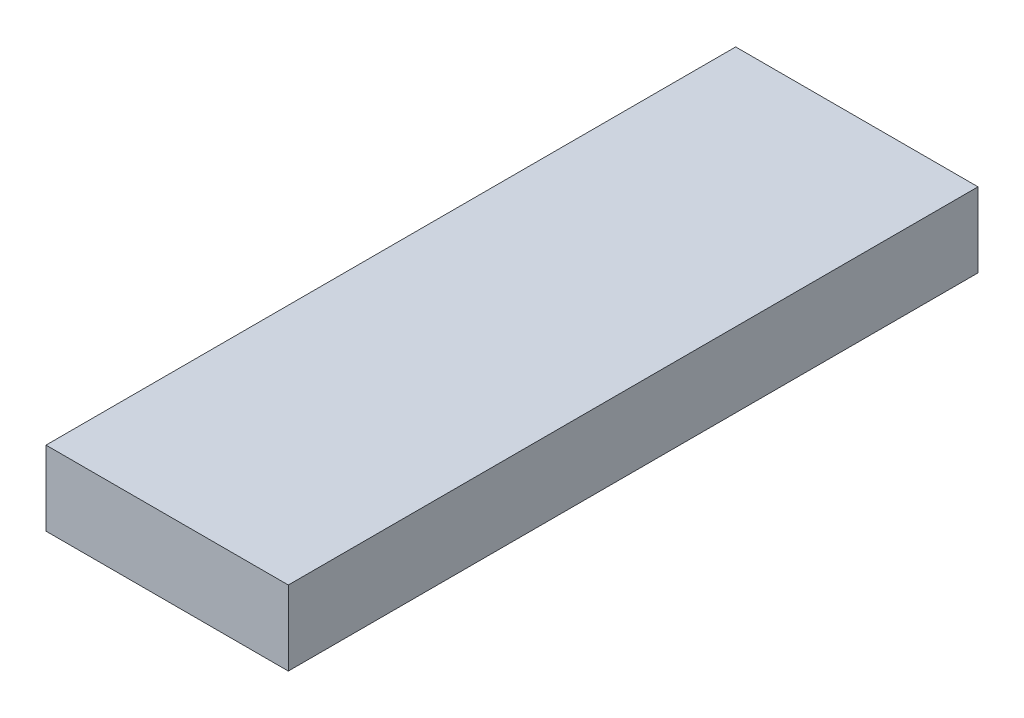
ISO-10303-21;
HEADER;
FILE_DESCRIPTION(('STEP AP214'),'2;1');
FILE_NAME('part.step','',(''),(''),'','','');
FILE_SCHEMA(('AUTOMOTIVE_DESIGN { 1 0 10303 214 1 1 1 1 }'));
ENDSEC;
DATA;
#1=APPLICATION_CONTEXT('core data for automotive mechanical design processes');
#2=APPLICATION_PROTOCOL_DEFINITION('international standard','automotive_design',2000,#1);
#3=PRODUCT_CONTEXT('',#1,'mechanical');
#4=PRODUCT('Part','Part','',(#3));
#5=PRODUCT_RELATED_PRODUCT_CATEGORY('part','',(#4));
#6=PRODUCT_DEFINITION_FORMATION('','',#4);
#7=PRODUCT_DEFINITION_CONTEXT('part definition',#1,'design');
#8=PRODUCT_DEFINITION('design','',#6,#7);
#9=PRODUCT_DEFINITION_SHAPE('','',#8);
#10=(LENGTH_UNIT() NAMED_UNIT(*) SI_UNIT(.MILLI.,.METRE.));
#11=(NAMED_UNIT(*) PLANE_ANGLE_UNIT() SI_UNIT($,.RADIAN.));
#12=(NAMED_UNIT(*) SI_UNIT($,.STERADIAN.) SOLID_ANGLE_UNIT());
#13=UNCERTAINTY_MEASURE_WITH_UNIT(LENGTH_MEASURE(1.E-05),#10,'distance_accuracy_value','');
#14=(GEOMETRIC_REPRESENTATION_CONTEXT(3) GLOBAL_UNCERTAINTY_ASSIGNED_CONTEXT((#13)) GLOBAL_UNIT_ASSIGNED_CONTEXT((#10,
#11,#12)) REPRESENTATION_CONTEXT('',''));
#15=CARTESIAN_POINT('',(0.,0.,0.));
#16=DIRECTION('',(0.,0.,1.));
#17=DIRECTION('',(1.,0.,0.));
#18=AXIS2_PLACEMENT_3D('',#15,#16,#17);
#19=CARTESIAN_POINT('',(0.,101.6,0.));
#20=DIRECTION('',(1.,0.,0.));
#21=DIRECTION('',(0.,0.,-1.));
#22=AXIS2_PLACEMENT_3D('',#19,#20,#21);
#23=PLANE('',#22);
#24=DIRECTION('',(0.,0.,1.));
#25=VECTOR('',#24,1.);
#26=CARTESIAN_POINT('',(0.,0.,0.));
#27=LINE('',#26,#25);
#28=CARTESIAN_POINT('',(0.,0.,-939.8));
#29=VERTEX_POINT('',#28);
#30=CARTESIAN_POINT('',(0.,0.,0.));
#31=VERTEX_POINT('',#30);
#32=EDGE_CURVE('E95',#29,#31,#27,.T.);
#33=ORIENTED_EDGE('',*,*,#32,.T.);
#34=DIRECTION('',(0.,-1.,0.));
#35=VECTOR('',#34,1.);
#36=CARTESIAN_POINT('',(0.,101.6,0.));
#37=LINE('',#36,#35);
#38=CARTESIAN_POINT('',(0.,101.6,0.));
#39=VERTEX_POINT('',#38);
#40=EDGE_CURVE('E11',#39,#31,#37,.T.);
#41=ORIENTED_EDGE('',*,*,#40,.F.);
#42=DIRECTION('',(0.,0.,1.));
#43=VECTOR('',#42,1.);
#44=CARTESIAN_POINT('',(0.,101.6,0.));
#45=LINE('',#44,#43);
#46=CARTESIAN_POINT('',(0.,101.6,-939.8));
#47=VERTEX_POINT('',#46);
#48=EDGE_CURVE('E83',#47,#39,#45,.T.);
#49=ORIENTED_EDGE('',*,*,#48,.F.);
#50=DIRECTION('',(0.,-1.,0.));
#51=VECTOR('',#50,1.);
#52=CARTESIAN_POINT('',(0.,101.6,-939.8));
#53=LINE('',#52,#51);
#54=EDGE_CURVE('E91',#47,#29,#53,.T.);
#55=ORIENTED_EDGE('',*,*,#54,.T.);
#56=EDGE_LOOP('',(#33,#41,#49,#55));
#57=FACE_BOUND('',#56,.T.);
#58=ADVANCED_FACE('F32',(#57),#23,.F.);
#59=CARTESIAN_POINT('',(0.,101.6,0.));
#60=DIRECTION('',(0.,0.,-1.));
#61=DIRECTION('',(-1.,0.,0.));
#62=AXIS2_PLACEMENT_3D('',#59,#60,#61);
#63=PLANE('',#62);
#64=DIRECTION('',(1.,0.,0.));
#65=VECTOR('',#64,1.);
#66=CARTESIAN_POINT('',(0.,0.,0.));
#67=LINE('',#66,#65);
#68=CARTESIAN_POINT('',(330.2,0.,0.));
#69=VERTEX_POINT('',#68);
#70=EDGE_CURVE('E87',#31,#69,#67,.T.);
#71=ORIENTED_EDGE('',*,*,#70,.T.);
#72=DIRECTION('',(0.,-1.,0.));
#73=VECTOR('',#72,1.);
#74=CARTESIAN_POINT('',(330.2,101.6,0.));
#75=LINE('',#74,#73);
#76=CARTESIAN_POINT('',(330.2,101.6,0.));
#77=VERTEX_POINT('',#76);
#78=EDGE_CURVE('E40',#77,#69,#75,.T.);
#79=ORIENTED_EDGE('',*,*,#78,.F.);
#80=DIRECTION('',(1.,0.,0.));
#81=VECTOR('',#80,1.);
#82=CARTESIAN_POINT('',(0.,101.6,0.));
#83=LINE('',#82,#81);
#84=EDGE_CURVE('E78',#39,#77,#83,.T.);
#85=ORIENTED_EDGE('',*,*,#84,.F.);
#86=ORIENTED_EDGE('',*,*,#40,.T.);
#87=EDGE_LOOP('',(#71,#79,#85,#86));
#88=FACE_BOUND('',#87,.T.);
#89=ADVANCED_FACE('F86',(#88),#63,.F.);
#90=CARTESIAN_POINT('',(330.2,101.6,0.));
#91=DIRECTION('',(-1.,0.,0.));
#92=DIRECTION('',(0.,0.,1.));
#93=AXIS2_PLACEMENT_3D('',#90,#91,#92);
#94=PLANE('',#93);
#95=DIRECTION('',(0.,0.,-1.));
#96=VECTOR('',#95,1.);
#97=CARTESIAN_POINT('',(330.2,0.,0.));
#98=LINE('',#97,#96);
#99=CARTESIAN_POINT('',(330.2,0.,-939.8));
#100=VERTEX_POINT('',#99);
#101=EDGE_CURVE('E65',#69,#100,#98,.T.);
#102=ORIENTED_EDGE('',*,*,#101,.T.);
#103=DIRECTION('',(0.,-1.,0.));
#104=VECTOR('',#103,1.);
#105=CARTESIAN_POINT('',(330.2,101.6,-939.8));
#106=LINE('',#105,#104);
#107=CARTESIAN_POINT('',(330.2,101.6,-939.8));
#108=VERTEX_POINT('',#107);
#109=EDGE_CURVE('E88',#108,#100,#106,.T.);
#110=ORIENTED_EDGE('',*,*,#109,.F.);
#111=DIRECTION('',(0.,0.,-1.));
#112=VECTOR('',#111,1.);
#113=CARTESIAN_POINT('',(330.2,101.6,0.));
#114=LINE('',#113,#112);
#115=EDGE_CURVE('E81',#77,#108,#114,.T.);
#116=ORIENTED_EDGE('',*,*,#115,.F.);
#117=ORIENTED_EDGE('',*,*,#78,.T.);
#118=EDGE_LOOP('',(#102,#110,#116,#117));
#119=FACE_BOUND('',#118,.T.);
#120=ADVANCED_FACE('F89',(#119),#94,.F.);
#121=CARTESIAN_POINT('',(0.,101.6,-939.8));
#122=DIRECTION('',(0.,0.,1.));
#123=DIRECTION('',(1.,0.,0.));
#124=AXIS2_PLACEMENT_3D('',#121,#122,#123);
#125=PLANE('',#124);
#126=DIRECTION('',(-1.,0.,0.));
#127=VECTOR('',#126,1.);
#128=CARTESIAN_POINT('',(0.,0.,-939.8));
#129=LINE('',#128,#127);
#130=EDGE_CURVE('E71',#100,#29,#129,.T.);
#131=ORIENTED_EDGE('',*,*,#130,.T.);
#132=ORIENTED_EDGE('',*,*,#54,.F.);
#133=DIRECTION('',(-1.,0.,0.));
#134=VECTOR('',#133,1.);
#135=CARTESIAN_POINT('',(0.,101.6,-939.8));
#136=LINE('',#135,#134);
#137=EDGE_CURVE('E48',#108,#47,#136,.T.);
#138=ORIENTED_EDGE('',*,*,#137,.F.);
#139=ORIENTED_EDGE('',*,*,#109,.T.);
#140=EDGE_LOOP('',(#131,#132,#138,#139));
#141=FACE_BOUND('',#140,.T.);
#142=ADVANCED_FACE('F102',(#141),#125,.F.);
#143=CARTESIAN_POINT('',(0.,101.6,0.));
#144=DIRECTION('',(0.,-1.,0.));
#145=DIRECTION('',(0.,0.,-1.));
#146=AXIS2_PLACEMENT_3D('',#143,#144,#145);
#147=PLANE('',#146);
#148=ORIENTED_EDGE('',*,*,#48,.T.);
#149=ORIENTED_EDGE('',*,*,#84,.T.);
#150=ORIENTED_EDGE('',*,*,#115,.T.);
#151=ORIENTED_EDGE('',*,*,#137,.T.);
#152=EDGE_LOOP('',(#148,#149,#150,#151));
#153=FACE_BOUND('',#152,.T.);
#154=ADVANCED_FACE('F79',(#153),#147,.F.);
#155=CARTESIAN_POINT('',(0.,0.,0.));
#156=DIRECTION('',(0.,-1.,0.));
#157=DIRECTION('',(0.,0.,-1.));
#158=AXIS2_PLACEMENT_3D('',#155,#156,#157);
#159=PLANE('',#158);
#160=ORIENTED_EDGE('',*,*,#32,.F.);
#161=ORIENTED_EDGE('',*,*,#130,.F.);
#162=ORIENTED_EDGE('',*,*,#101,.F.);
#163=ORIENTED_EDGE('',*,*,#70,.F.);
#164=EDGE_LOOP('',(#160,#161,#162,#163));
#165=FACE_BOUND('',#164,.T.);
#166=ADVANCED_FACE('F105',(#165),#159,.T.);
#167=CLOSED_SHELL('',(#58,#89,#120,#142,#154,#166));
#168=MANIFOLD_SOLID_BREP('B2',#167);
#169=ADVANCED_BREP_SHAPE_REPRESENTATION('',(#18,#168),#14);
#170=SHAPE_DEFINITION_REPRESENTATION(#9,#169);
ENDSEC;
END-ISO-10303-21;
